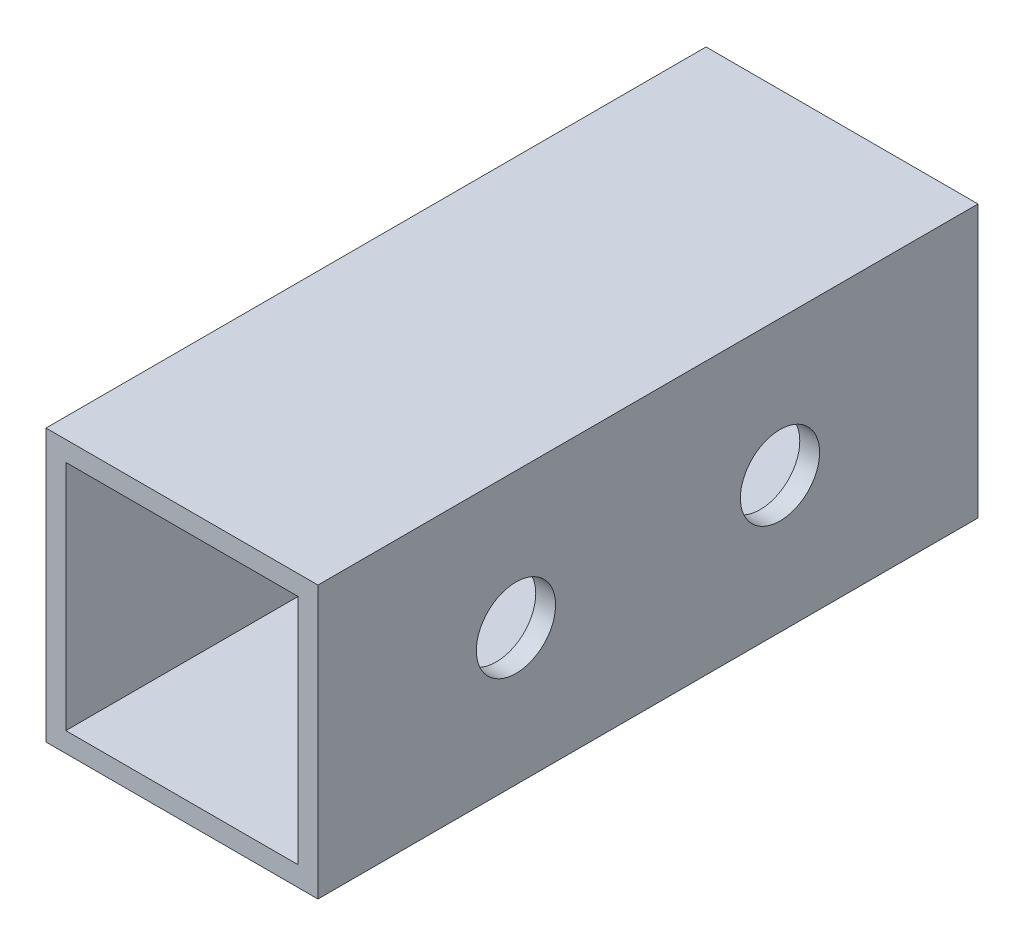
ISO-10303-21;
HEADER;
FILE_DESCRIPTION(('STEP AP214'),'2;1');
FILE_NAME('part.step','',(''),(''),'','','');
FILE_SCHEMA(('AUTOMOTIVE_DESIGN { 1 0 10303 214 1 1 1 1 }'));
ENDSEC;
DATA;
#1=APPLICATION_CONTEXT('core data for automotive mechanical design processes');
#2=APPLICATION_PROTOCOL_DEFINITION('international standard','automotive_design',2000,#1);
#3=PRODUCT_CONTEXT('',#1,'mechanical');
#4=PRODUCT('Part','Part','',(#3));
#5=PRODUCT_RELATED_PRODUCT_CATEGORY('part','',(#4));
#6=PRODUCT_DEFINITION_FORMATION('','',#4);
#7=PRODUCT_DEFINITION_CONTEXT('part definition',#1,'design');
#8=PRODUCT_DEFINITION('design','',#6,#7);
#9=PRODUCT_DEFINITION_SHAPE('','',#8);
#10=(LENGTH_UNIT() NAMED_UNIT(*) SI_UNIT(.MILLI.,.METRE.));
#11=(NAMED_UNIT(*) PLANE_ANGLE_UNIT() SI_UNIT($,.RADIAN.));
#12=(NAMED_UNIT(*) SI_UNIT($,.STERADIAN.) SOLID_ANGLE_UNIT());
#13=UNCERTAINTY_MEASURE_WITH_UNIT(LENGTH_MEASURE(1.E-05),#10,'distance_accuracy_value','');
#14=(GEOMETRIC_REPRESENTATION_CONTEXT(3) GLOBAL_UNCERTAINTY_ASSIGNED_CONTEXT((#13)) GLOBAL_UNIT_ASSIGNED_CONTEXT((#10,
#11,#12)) REPRESENTATION_CONTEXT('',''));
#15=CARTESIAN_POINT('',(0.,0.,0.));
#16=DIRECTION('',(0.,0.,1.));
#17=DIRECTION('',(1.,0.,0.));
#18=AXIS2_PLACEMENT_3D('',#15,#16,#17);
#19=CARTESIAN_POINT('',(0.,0.,50.));
#20=DIRECTION('',(0.,0.,1.));
#21=DIRECTION('',(1.,0.,0.));
#22=AXIS2_PLACEMENT_3D('',#19,#20,#21);
#23=PLANE('',#22);
#24=DIRECTION('',(0.,-1.,0.));
#25=VECTOR('',#24,1.);
#26=CARTESIAN_POINT('',(-39.2867719170048,19.8436974789916,50.));
#27=LINE('',#26,#25);
#28=CARTESIAN_POINT('',(-39.2867719170048,19.8436974789916,50.));
#29=VERTEX_POINT('',#28);
#30=CARTESIAN_POINT('',(-39.2867719170048,-0.756302521008396,50.));
#31=VERTEX_POINT('',#30);
#32=EDGE_CURVE('E138',#29,#31,#27,.T.);
#33=ORIENTED_EDGE('',*,*,#32,.T.);
#34=DIRECTION('',(1.,0.,0.));
#35=VECTOR('',#34,1.);
#36=CARTESIAN_POINT('',(-39.2867719170048,-0.756302521008396,50.));
#37=LINE('',#36,#35);
#38=CARTESIAN_POINT('',(-18.6867719170048,-0.756302521008396,50.));
#39=VERTEX_POINT('',#38);
#40=EDGE_CURVE('E141',#31,#39,#37,.T.);
#41=ORIENTED_EDGE('',*,*,#40,.T.);
#42=DIRECTION('',(0.,1.,0.));
#43=VECTOR('',#42,1.);
#44=CARTESIAN_POINT('',(-18.6867719170048,19.8436974789916,50.));
#45=LINE('',#44,#43);
#46=CARTESIAN_POINT('',(-18.6867719170048,19.8436974789916,50.));
#47=VERTEX_POINT('',#46);
#48=EDGE_CURVE('E144',#39,#47,#45,.T.);
#49=ORIENTED_EDGE('',*,*,#48,.T.);
#50=DIRECTION('',(-1.,0.,0.));
#51=VECTOR('',#50,1.);
#52=CARTESIAN_POINT('',(-39.2867719170048,19.8436974789916,50.));
#53=LINE('',#52,#51);
#54=EDGE_CURVE('E146',#47,#29,#53,.T.);
#55=ORIENTED_EDGE('',*,*,#54,.T.);
#56=EDGE_LOOP('',(#33,#41,#49,#55));
#57=FACE_BOUND('',#56,.T.);
#58=DIRECTION('',(1.,0.,0.));
#59=VECTOR('',#58,1.);
#60=CARTESIAN_POINT('',(-37.7867719170048,0.743697478991604,50.));
#61=LINE('',#60,#59);
#62=CARTESIAN_POINT('',(-37.7867719170048,0.743697478991604,50.));
#63=VERTEX_POINT('',#62);
#64=CARTESIAN_POINT('',(-20.1867719170048,0.743697478991605,50.));
#65=VERTEX_POINT('',#64);
#66=EDGE_CURVE('E108',#63,#65,#61,.T.);
#67=ORIENTED_EDGE('',*,*,#66,.F.);
#68=DIRECTION('',(0.,-1.,0.));
#69=VECTOR('',#68,1.);
#70=CARTESIAN_POINT('',(-37.7867719170048,18.3436974789916,50.));
#71=LINE('',#70,#69);
#72=CARTESIAN_POINT('',(-37.7867719170048,18.3436974789916,50.));
#73=VERTEX_POINT('',#72);
#74=EDGE_CURVE('E100',#73,#63,#71,.T.);
#75=ORIENTED_EDGE('',*,*,#74,.F.);
#76=DIRECTION('',(-1.,0.,0.));
#77=VECTOR('',#76,1.);
#78=CARTESIAN_POINT('',(-37.7867719170048,18.3436974789916,50.));
#79=LINE('',#78,#77);
#80=CARTESIAN_POINT('',(-20.1867719170048,18.3436974789916,50.));
#81=VERTEX_POINT('',#80);
#82=EDGE_CURVE('E122',#81,#73,#79,.T.);
#83=ORIENTED_EDGE('',*,*,#82,.F.);
#84=DIRECTION('',(0.,1.,0.));
#85=VECTOR('',#84,1.);
#86=CARTESIAN_POINT('',(-20.1867719170048,18.3436974789916,50.));
#87=LINE('',#86,#85);
#88=EDGE_CURVE('E120',#65,#81,#87,.T.);
#89=ORIENTED_EDGE('',*,*,#88,.F.);
#90=EDGE_LOOP('',(#67,#75,#83,#89));
#91=FACE_BOUND('',#90,.T.);
#92=ADVANCED_FACE('F33',(#57,#91),#23,.T.);
#93=CARTESIAN_POINT('',(0.,0.,0.));
#94=DIRECTION('',(0.,0.,1.));
#95=DIRECTION('',(1.,0.,0.));
#96=AXIS2_PLACEMENT_3D('',#93,#94,#95);
#97=PLANE('',#96);
#98=DIRECTION('',(0.,-1.,0.));
#99=VECTOR('',#98,1.);
#100=CARTESIAN_POINT('',(-39.2867719170048,19.8436974789916,0.));
#101=LINE('',#100,#99);
#102=CARTESIAN_POINT('',(-39.2867719170048,19.8436974789916,0.));
#103=VERTEX_POINT('',#102);
#104=CARTESIAN_POINT('',(-39.2867719170048,-0.756302521008396,0.));
#105=VERTEX_POINT('',#104);
#106=EDGE_CURVE('E116',#103,#105,#101,.T.);
#107=ORIENTED_EDGE('',*,*,#106,.F.);
#108=DIRECTION('',(-1.,0.,0.));
#109=VECTOR('',#108,1.);
#110=CARTESIAN_POINT('',(-39.2867719170048,19.8436974789916,0.));
#111=LINE('',#110,#109);
#112=CARTESIAN_POINT('',(-18.6867719170048,19.8436974789916,0.));
#113=VERTEX_POINT('',#112);
#114=EDGE_CURVE('E142',#113,#103,#111,.T.);
#115=ORIENTED_EDGE('',*,*,#114,.F.);
#116=DIRECTION('',(0.,1.,0.));
#117=VECTOR('',#116,1.);
#118=CARTESIAN_POINT('',(-18.6867719170048,19.8436974789916,0.));
#119=LINE('',#118,#117);
#120=CARTESIAN_POINT('',(-18.6867719170048,-0.756302521008396,0.));
#121=VERTEX_POINT('',#120);
#122=EDGE_CURVE('E153',#121,#113,#119,.T.);
#123=ORIENTED_EDGE('',*,*,#122,.F.);
#124=DIRECTION('',(1.,0.,0.));
#125=VECTOR('',#124,1.);
#126=CARTESIAN_POINT('',(-39.2867719170048,-0.756302521008396,0.));
#127=LINE('',#126,#125);
#128=EDGE_CURVE('E151',#105,#121,#127,.T.);
#129=ORIENTED_EDGE('',*,*,#128,.F.);
#130=EDGE_LOOP('',(#107,#115,#123,#129));
#131=FACE_BOUND('',#130,.T.);
#132=DIRECTION('',(0.,-1.,0.));
#133=VECTOR('',#132,1.);
#134=CARTESIAN_POINT('',(-37.7867719170048,18.3436974789916,0.));
#135=LINE('',#134,#133);
#136=CARTESIAN_POINT('',(-37.7867719170048,18.3436974789916,0.));
#137=VERTEX_POINT('',#136);
#138=CARTESIAN_POINT('',(-37.7867719170048,0.743697478991604,0.));
#139=VERTEX_POINT('',#138);
#140=EDGE_CURVE('E58',#137,#139,#135,.T.);
#141=ORIENTED_EDGE('',*,*,#140,.T.);
#142=DIRECTION('',(1.,0.,0.));
#143=VECTOR('',#142,1.);
#144=CARTESIAN_POINT('',(-37.7867719170048,0.743697478991604,0.));
#145=LINE('',#144,#143);
#146=CARTESIAN_POINT('',(-20.1867719170048,0.743697478991605,0.));
#147=VERTEX_POINT('',#146);
#148=EDGE_CURVE('E115',#139,#147,#145,.T.);
#149=ORIENTED_EDGE('',*,*,#148,.T.);
#150=DIRECTION('',(0.,1.,0.));
#151=VECTOR('',#150,1.);
#152=CARTESIAN_POINT('',(-20.1867719170048,18.3436974789916,0.));
#153=LINE('',#152,#151);
#154=CARTESIAN_POINT('',(-20.1867719170048,18.3436974789916,0.));
#155=VERTEX_POINT('',#154);
#156=EDGE_CURVE('E130',#147,#155,#153,.T.);
#157=ORIENTED_EDGE('',*,*,#156,.T.);
#158=DIRECTION('',(-1.,0.,0.));
#159=VECTOR('',#158,1.);
#160=CARTESIAN_POINT('',(-37.7867719170048,18.3436974789916,0.));
#161=LINE('',#160,#159);
#162=EDGE_CURVE('E109',#155,#137,#161,.T.);
#163=ORIENTED_EDGE('',*,*,#162,.T.);
#164=EDGE_LOOP('',(#141,#149,#157,#163));
#165=FACE_BOUND('',#164,.T.);
#166=ADVANCED_FACE('F200',(#131,#165),#97,.F.);
#167=CARTESIAN_POINT('',(-39.2867719170048,19.8436974789916,50.));
#168=DIRECTION('',(1.,0.,0.));
#169=DIRECTION('',(0.,1.,0.));
#170=AXIS2_PLACEMENT_3D('',#167,#168,#169);
#171=PLANE('',#170);
#172=CARTESIAN_POINT('',(-39.2867719170048,9.5436974789916,35.));
#173=DIRECTION('',(1.,0.,0.));
#174=DIRECTION('',(0.,1.,0.));
#175=AXIS2_PLACEMENT_3D('',#172,#173,#174);
#176=CIRCLE('',#175,3.);
#177=CARTESIAN_POINT('',(-39.2867719170048,12.5436974789916,35.));
#178=VERTEX_POINT('',#177);
#179=EDGE_CURVE('E165',#178,#178,#176,.T.);
#180=ORIENTED_EDGE('',*,*,#179,.T.);
#181=EDGE_LOOP('',(#180));
#182=FACE_BOUND('',#181,.T.);
#183=CARTESIAN_POINT('',(-39.2867719170048,9.5436974789916,15.));
#184=DIRECTION('',(1.,0.,0.));
#185=DIRECTION('',(0.,1.,0.));
#186=AXIS2_PLACEMENT_3D('',#183,#184,#185);
#187=CIRCLE('',#186,3.);
#188=CARTESIAN_POINT('',(-39.2867719170048,12.5436974789916,15.));
#189=VERTEX_POINT('',#188);
#190=EDGE_CURVE('E176',#189,#189,#187,.T.);
#191=ORIENTED_EDGE('',*,*,#190,.T.);
#192=EDGE_LOOP('',(#191));
#193=FACE_BOUND('',#192,.T.);
#194=ORIENTED_EDGE('',*,*,#106,.T.);
#195=DIRECTION('',(0.,0.,-1.));
#196=VECTOR('',#195,1.);
#197=CARTESIAN_POINT('',(-39.2867719170048,-0.756302521008396,50.));
#198=LINE('',#197,#196);
#199=EDGE_CURVE('E11',#31,#105,#198,.T.);
#200=ORIENTED_EDGE('',*,*,#199,.F.);
#201=ORIENTED_EDGE('',*,*,#32,.F.);
#202=DIRECTION('',(0.,0.,-1.));
#203=VECTOR('',#202,1.);
#204=CARTESIAN_POINT('',(-39.2867719170048,19.8436974789916,50.));
#205=LINE('',#204,#203);
#206=EDGE_CURVE('E148',#29,#103,#205,.T.);
#207=ORIENTED_EDGE('',*,*,#206,.T.);
#208=EDGE_LOOP('',(#194,#200,#201,#207));
#209=FACE_BOUND('',#208,.T.);
#210=ADVANCED_FACE('F35',(#182,#193,#209),#171,.F.);
#211=CARTESIAN_POINT('',(-39.2867719170048,-0.756302521008396,50.));
#212=DIRECTION('',(0.,1.,0.));
#213=DIRECTION('',(0.,0.,1.));
#214=AXIS2_PLACEMENT_3D('',#211,#212,#213);
#215=PLANE('',#214);
#216=ORIENTED_EDGE('',*,*,#128,.T.);
#217=DIRECTION('',(0.,0.,-1.));
#218=VECTOR('',#217,1.);
#219=CARTESIAN_POINT('',(-18.6867719170048,-0.756302521008396,50.));
#220=LINE('',#219,#218);
#221=EDGE_CURVE('E42',#39,#121,#220,.T.);
#222=ORIENTED_EDGE('',*,*,#221,.F.);
#223=ORIENTED_EDGE('',*,*,#40,.F.);
#224=ORIENTED_EDGE('',*,*,#199,.T.);
#225=EDGE_LOOP('',(#216,#222,#223,#224));
#226=FACE_BOUND('',#225,.T.);
#227=ADVANCED_FACE('F226',(#226),#215,.F.);
#228=CARTESIAN_POINT('',(-18.6867719170048,19.8436974789916,50.));
#229=DIRECTION('',(-1.,0.,0.));
#230=DIRECTION('',(0.,-1.,0.));
#231=AXIS2_PLACEMENT_3D('',#228,#229,#230);
#232=PLANE('',#231);
#233=CARTESIAN_POINT('',(-18.6867719170048,9.5436974789916,35.));
#234=DIRECTION('',(1.,0.,0.));
#235=DIRECTION('',(0.,1.,0.));
#236=AXIS2_PLACEMENT_3D('',#233,#234,#235);
#237=CIRCLE('',#236,3.);
#238=CARTESIAN_POINT('',(-18.6867719170048,12.5436974789916,35.));
#239=VERTEX_POINT('',#238);
#240=EDGE_CURVE('E171',#239,#239,#237,.T.);
#241=ORIENTED_EDGE('',*,*,#240,.F.);
#242=EDGE_LOOP('',(#241));
#243=FACE_BOUND('',#242,.T.);
#244=CARTESIAN_POINT('',(-18.6867719170048,9.5436974789916,15.));
#245=DIRECTION('',(1.,0.,0.));
#246=DIRECTION('',(0.,1.,0.));
#247=AXIS2_PLACEMENT_3D('',#244,#245,#246);
#248=CIRCLE('',#247,3.);
#249=CARTESIAN_POINT('',(-18.6867719170048,12.5436974789916,15.));
#250=VERTEX_POINT('',#249);
#251=EDGE_CURVE('E181',#250,#250,#248,.T.);
#252=ORIENTED_EDGE('',*,*,#251,.F.);
#253=EDGE_LOOP('',(#252));
#254=FACE_BOUND('',#253,.T.);
#255=ORIENTED_EDGE('',*,*,#122,.T.);
#256=DIRECTION('',(0.,0.,-1.));
#257=VECTOR('',#256,1.);
#258=CARTESIAN_POINT('',(-18.6867719170048,19.8436974789916,50.));
#259=LINE('',#258,#257);
#260=EDGE_CURVE('E158',#47,#113,#259,.T.);
#261=ORIENTED_EDGE('',*,*,#260,.F.);
#262=ORIENTED_EDGE('',*,*,#48,.F.);
#263=ORIENTED_EDGE('',*,*,#221,.T.);
#264=EDGE_LOOP('',(#255,#261,#262,#263));
#265=FACE_BOUND('',#264,.T.);
#266=ADVANCED_FACE('F223',(#243,#254,#265),#232,.F.);
#267=CARTESIAN_POINT('',(-39.2867719170048,19.8436974789916,50.));
#268=DIRECTION('',(0.,-1.,0.));
#269=DIRECTION('',(0.,0.,-1.));
#270=AXIS2_PLACEMENT_3D('',#267,#268,#269);
#271=PLANE('',#270);
#272=ORIENTED_EDGE('',*,*,#114,.T.);
#273=ORIENTED_EDGE('',*,*,#206,.F.);
#274=ORIENTED_EDGE('',*,*,#54,.F.);
#275=ORIENTED_EDGE('',*,*,#260,.T.);
#276=EDGE_LOOP('',(#272,#273,#274,#275));
#277=FACE_BOUND('',#276,.T.);
#278=ADVANCED_FACE('F220',(#277),#271,.F.);
#279=CARTESIAN_POINT('',(-37.7867719170048,18.3436974789916,50.));
#280=DIRECTION('',(1.,0.,0.));
#281=DIRECTION('',(0.,1.,0.));
#282=AXIS2_PLACEMENT_3D('',#279,#280,#281);
#283=PLANE('',#282);
#284=CARTESIAN_POINT('',(-37.7867719170048,9.5436974789916,35.));
#285=DIRECTION('',(1.,0.,0.));
#286=DIRECTION('',(0.,1.,0.));
#287=AXIS2_PLACEMENT_3D('',#284,#285,#286);
#288=CIRCLE('',#287,3.);
#289=CARTESIAN_POINT('',(-37.7867719170048,12.5436974789916,35.));
#290=VERTEX_POINT('',#289);
#291=EDGE_CURVE('E128',#290,#290,#288,.T.);
#292=ORIENTED_EDGE('',*,*,#291,.F.);
#293=EDGE_LOOP('',(#292));
#294=FACE_BOUND('',#293,.T.);
#295=CARTESIAN_POINT('',(-37.7867719170048,9.5436974789916,15.));
#296=DIRECTION('',(1.,0.,0.));
#297=DIRECTION('',(0.,1.,0.));
#298=AXIS2_PLACEMENT_3D('',#295,#296,#297);
#299=CIRCLE('',#298,3.);
#300=CARTESIAN_POINT('',(-37.7867719170048,12.5436974789916,15.));
#301=VERTEX_POINT('',#300);
#302=EDGE_CURVE('E164',#301,#301,#299,.T.);
#303=ORIENTED_EDGE('',*,*,#302,.F.);
#304=EDGE_LOOP('',(#303));
#305=FACE_BOUND('',#304,.T.);
#306=ORIENTED_EDGE('',*,*,#140,.F.);
#307=DIRECTION('',(0.,0.,-1.));
#308=VECTOR('',#307,1.);
#309=CARTESIAN_POINT('',(-37.7867719170048,18.3436974789916,50.));
#310=LINE('',#309,#308);
#311=EDGE_CURVE('E104',#73,#137,#310,.T.);
#312=ORIENTED_EDGE('',*,*,#311,.F.);
#313=ORIENTED_EDGE('',*,*,#74,.T.);
#314=DIRECTION('',(0.,0.,-1.));
#315=VECTOR('',#314,1.);
#316=CARTESIAN_POINT('',(-37.7867719170048,0.743697478991604,50.));
#317=LINE('',#316,#315);
#318=EDGE_CURVE('E103',#63,#139,#317,.T.);
#319=ORIENTED_EDGE('',*,*,#318,.T.);
#320=EDGE_LOOP('',(#306,#312,#313,#319));
#321=FACE_BOUND('',#320,.T.);
#322=ADVANCED_FACE('F102',(#294,#305,#321),#283,.T.);
#323=CARTESIAN_POINT('',(-37.7867719170048,0.743697478991604,50.));
#324=DIRECTION('',(0.,1.,0.));
#325=DIRECTION('',(-1.,0.,0.));
#326=AXIS2_PLACEMENT_3D('',#323,#324,#325);
#327=PLANE('',#326);
#328=ORIENTED_EDGE('',*,*,#148,.F.);
#329=ORIENTED_EDGE('',*,*,#318,.F.);
#330=ORIENTED_EDGE('',*,*,#66,.T.);
#331=DIRECTION('',(0.,0.,-1.));
#332=VECTOR('',#331,1.);
#333=CARTESIAN_POINT('',(-20.1867719170048,0.743697478991605,50.));
#334=LINE('',#333,#332);
#335=EDGE_CURVE('E117',#65,#147,#334,.T.);
#336=ORIENTED_EDGE('',*,*,#335,.T.);
#337=EDGE_LOOP('',(#328,#329,#330,#336));
#338=FACE_BOUND('',#337,.T.);
#339=ADVANCED_FACE('F112',(#338),#327,.T.);
#340=CARTESIAN_POINT('',(-20.1867719170048,18.3436974789916,50.));
#341=DIRECTION('',(-1.,0.,0.));
#342=DIRECTION('',(0.,-1.,0.));
#343=AXIS2_PLACEMENT_3D('',#340,#341,#342);
#344=PLANE('',#343);
#345=CARTESIAN_POINT('',(-20.1867719170048,9.5436974789916,35.));
#346=DIRECTION('',(-1.,0.,0.));
#347=DIRECTION('',(0.,-1.,0.));
#348=AXIS2_PLACEMENT_3D('',#345,#346,#347);
#349=CIRCLE('',#348,3.);
#350=CARTESIAN_POINT('',(-20.1867719170048,6.5436974789916,35.));
#351=VERTEX_POINT('',#350);
#352=EDGE_CURVE('E37',#351,#351,#349,.T.);
#353=ORIENTED_EDGE('',*,*,#352,.F.);
#354=EDGE_LOOP('',(#353));
#355=FACE_BOUND('',#354,.T.);
#356=CARTESIAN_POINT('',(-20.1867719170048,9.5436974789916,15.));
#357=DIRECTION('',(-1.,0.,0.));
#358=DIRECTION('',(0.,-1.,0.));
#359=AXIS2_PLACEMENT_3D('',#356,#357,#358);
#360=CIRCLE('',#359,3.);
#361=CARTESIAN_POINT('',(-20.1867719170048,6.5436974789916,15.));
#362=VERTEX_POINT('',#361);
#363=EDGE_CURVE('E162',#362,#362,#360,.T.);
#364=ORIENTED_EDGE('',*,*,#363,.F.);
#365=EDGE_LOOP('',(#364));
#366=FACE_BOUND('',#365,.T.);
#367=ORIENTED_EDGE('',*,*,#156,.F.);
#368=ORIENTED_EDGE('',*,*,#335,.F.);
#369=ORIENTED_EDGE('',*,*,#88,.T.);
#370=DIRECTION('',(0.,0.,-1.));
#371=VECTOR('',#370,1.);
#372=CARTESIAN_POINT('',(-20.1867719170048,18.3436974789916,50.));
#373=LINE('',#372,#371);
#374=EDGE_CURVE('E50',#81,#155,#373,.T.);
#375=ORIENTED_EDGE('',*,*,#374,.T.);
#376=EDGE_LOOP('',(#367,#368,#369,#375));
#377=FACE_BOUND('',#376,.T.);
#378=ADVANCED_FACE('F192',(#355,#366,#377),#344,.T.);
#379=CARTESIAN_POINT('',(-37.7867719170048,18.3436974789916,50.));
#380=DIRECTION('',(0.,-1.,0.));
#381=DIRECTION('',(0.,0.,-1.));
#382=AXIS2_PLACEMENT_3D('',#379,#380,#381);
#383=PLANE('',#382);
#384=ORIENTED_EDGE('',*,*,#162,.F.);
#385=ORIENTED_EDGE('',*,*,#374,.F.);
#386=ORIENTED_EDGE('',*,*,#82,.T.);
#387=ORIENTED_EDGE('',*,*,#311,.T.);
#388=EDGE_LOOP('',(#384,#385,#386,#387));
#389=FACE_BOUND('',#388,.T.);
#390=ADVANCED_FACE('F195',(#389),#383,.T.);
#391=CARTESIAN_POINT('',(-39.2867719170048,9.5436974789916,15.));
#392=DIRECTION('',(1.,0.,0.));
#393=DIRECTION('',(0.,1.,0.));
#394=AXIS2_PLACEMENT_3D('',#391,#392,#393);
#395=CYLINDRICAL_SURFACE('',#394,3.);
#396=ORIENTED_EDGE('',*,*,#363,.T.);
#397=EDGE_LOOP('',(#396));
#398=FACE_BOUND('',#397,.T.);
#399=ORIENTED_EDGE('',*,*,#251,.T.);
#400=EDGE_LOOP('',(#399));
#401=FACE_BOUND('',#400,.T.);
#402=ADVANCED_FACE('F202',(#398,#401),#395,.F.);
#403=CARTESIAN_POINT('',(-39.2867719170048,9.5436974789916,35.));
#404=DIRECTION('',(1.,0.,0.));
#405=DIRECTION('',(0.,1.,0.));
#406=AXIS2_PLACEMENT_3D('',#403,#404,#405);
#407=CYLINDRICAL_SURFACE('',#406,3.);
#408=ORIENTED_EDGE('',*,*,#352,.T.);
#409=EDGE_LOOP('',(#408));
#410=FACE_BOUND('',#409,.T.);
#411=ORIENTED_EDGE('',*,*,#240,.T.);
#412=EDGE_LOOP('',(#411));
#413=FACE_BOUND('',#412,.T.);
#414=ADVANCED_FACE('F189',(#410,#413),#407,.F.);
#415=ORIENTED_EDGE('',*,*,#302,.T.);
#416=EDGE_LOOP('',(#415));
#417=FACE_BOUND('',#416,.T.);
#418=ORIENTED_EDGE('',*,*,#190,.F.);
#419=EDGE_LOOP('',(#418));
#420=FACE_BOUND('',#419,.T.);
#421=ADVANCED_FACE('F208',(#417,#420),#395,.F.);
#422=ORIENTED_EDGE('',*,*,#291,.T.);
#423=EDGE_LOOP('',(#422));
#424=FACE_BOUND('',#423,.T.);
#425=ORIENTED_EDGE('',*,*,#179,.F.);
#426=EDGE_LOOP('',(#425));
#427=FACE_BOUND('',#426,.T.);
#428=ADVANCED_FACE('F251',(#424,#427),#407,.F.);
#429=CLOSED_SHELL('',(#92,#166,#210,#227,#266,#278,#322,#339,#378,#390,#402,#414,#421,#428));
#430=MANIFOLD_SOLID_BREP('B2',#429);
#431=ADVANCED_BREP_SHAPE_REPRESENTATION('',(#18,#430),#14);
#432=SHAPE_DEFINITION_REPRESENTATION(#9,#431);
ENDSEC;
END-ISO-10303-21;
